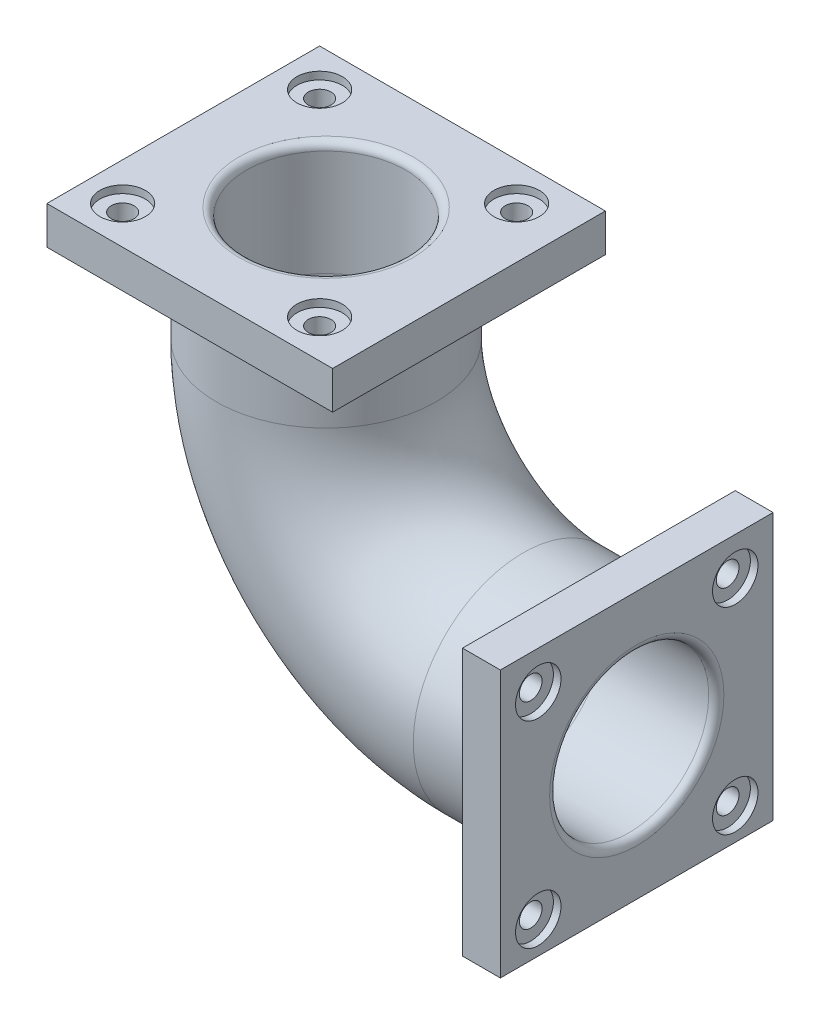
ISO-10303-21;
HEADER;
FILE_DESCRIPTION(('STEP AP214'),'2;1');
FILE_NAME('part.step','',(''),(''),'','','');
FILE_SCHEMA(('AUTOMOTIVE_DESIGN { 1 0 10303 214 1 1 1 1 }'));
ENDSEC;
DATA;
#1=APPLICATION_CONTEXT('core data for automotive mechanical design processes');
#2=APPLICATION_PROTOCOL_DEFINITION('international standard','automotive_design',2000,#1);
#3=PRODUCT_CONTEXT('',#1,'mechanical');
#4=PRODUCT('Part','Part','',(#3));
#5=PRODUCT_RELATED_PRODUCT_CATEGORY('part','',(#4));
#6=PRODUCT_DEFINITION_FORMATION('','',#4);
#7=PRODUCT_DEFINITION_CONTEXT('part definition',#1,'design');
#8=PRODUCT_DEFINITION('design','',#6,#7);
#9=PRODUCT_DEFINITION_SHAPE('','',#8);
#10=(LENGTH_UNIT() NAMED_UNIT(*) SI_UNIT(.MILLI.,.METRE.));
#11=(NAMED_UNIT(*) PLANE_ANGLE_UNIT() SI_UNIT($,.RADIAN.));
#12=(NAMED_UNIT(*) SI_UNIT($,.STERADIAN.) SOLID_ANGLE_UNIT());
#13=UNCERTAINTY_MEASURE_WITH_UNIT(LENGTH_MEASURE(1.E-05),#10,'distance_accuracy_value','');
#14=(GEOMETRIC_REPRESENTATION_CONTEXT(3) GLOBAL_UNCERTAINTY_ASSIGNED_CONTEXT((#13)) GLOBAL_UNIT_ASSIGNED_CONTEXT((#10,
#11,#12)) REPRESENTATION_CONTEXT('',''));
#15=CARTESIAN_POINT('',(0.,0.,0.));
#16=DIRECTION('',(0.,0.,1.));
#17=DIRECTION('',(1.,0.,0.));
#18=AXIS2_PLACEMENT_3D('',#15,#16,#17);
#19=CARTESIAN_POINT('',(-398.580538002043,100.,130.));
#20=DIRECTION('',(0.,1.,0.));
#21=DIRECTION('',(0.,0.,1.));
#22=AXIS2_PLACEMENT_3D('',#19,#20,#21);
#23=CYLINDRICAL_SURFACE('',#22,15.);
#24=CARTESIAN_POINT('',(-398.580538002043,100.,130.));
#25=DIRECTION('',(0.,1.,0.));
#26=DIRECTION('',(0.,0.,1.));
#27=AXIS2_PLACEMENT_3D('',#24,#25,#26);
#28=CIRCLE('',#27,15.);
#29=CARTESIAN_POINT('',(-398.580538002043,100.,145.));
#30=VERTEX_POINT('',#29);
#31=EDGE_CURVE('E392',#30,#30,#28,.T.);
#32=ORIENTED_EDGE('',*,*,#31,.F.);
#33=EDGE_LOOP('',(#32));
#34=FACE_BOUND('',#33,.T.);
#35=CARTESIAN_POINT('',(-398.580538002043,140.,130.));
#36=DIRECTION('',(0.,1.,0.));
#37=DIRECTION('',(0.,0.,1.));
#38=AXIS2_PLACEMENT_3D('',#35,#36,#37);
#39=CIRCLE('',#38,15.);
#40=CARTESIAN_POINT('',(-398.580538002043,140.,145.));
#41=VERTEX_POINT('',#40);
#42=EDGE_CURVE('E429',#41,#41,#39,.T.);
#43=ORIENTED_EDGE('',*,*,#42,.T.);
#44=EDGE_LOOP('',(#43));
#45=FACE_BOUND('',#44,.T.);
#46=ADVANCED_FACE('F33',(#34,#45),#23,.F.);
#47=CARTESIAN_POINT('',(-398.580538002044,100.,-130.));
#48=DIRECTION('',(0.,1.,0.));
#49=DIRECTION('',(0.,0.,1.));
#50=AXIS2_PLACEMENT_3D('',#47,#48,#49);
#51=CYLINDRICAL_SURFACE('',#50,15.);
#52=CARTESIAN_POINT('',(-398.580538002044,100.,-130.));
#53=DIRECTION('',(0.,1.,0.));
#54=DIRECTION('',(0.,0.,1.));
#55=AXIS2_PLACEMENT_3D('',#52,#53,#54);
#56=CIRCLE('',#55,15.);
#57=CARTESIAN_POINT('',(-398.580538002044,100.,-115.));
#58=VERTEX_POINT('',#57);
#59=EDGE_CURVE('E397',#58,#58,#56,.T.);
#60=ORIENTED_EDGE('',*,*,#59,.F.);
#61=EDGE_LOOP('',(#60));
#62=FACE_BOUND('',#61,.T.);
#63=CARTESIAN_POINT('',(-398.580538002044,140.,-130.));
#64=DIRECTION('',(0.,1.,0.));
#65=DIRECTION('',(0.,0.,1.));
#66=AXIS2_PLACEMENT_3D('',#63,#64,#65);
#67=CIRCLE('',#66,15.);
#68=CARTESIAN_POINT('',(-398.580538002044,140.,-115.));
#69=VERTEX_POINT('',#68);
#70=EDGE_CURVE('E438',#69,#69,#67,.T.);
#71=ORIENTED_EDGE('',*,*,#70,.T.);
#72=EDGE_LOOP('',(#71));
#73=FACE_BOUND('',#72,.T.);
#74=ADVANCED_FACE('F247',(#62,#73),#51,.F.);
#75=CARTESIAN_POINT('',(-138.580538002044,100.,-130.));
#76=DIRECTION('',(0.,1.,0.));
#77=DIRECTION('',(0.,0.,1.));
#78=AXIS2_PLACEMENT_3D('',#75,#76,#77);
#79=CYLINDRICAL_SURFACE('',#78,15.);
#80=CARTESIAN_POINT('',(-138.580538002044,100.,-130.));
#81=DIRECTION('',(0.,1.,0.));
#82=DIRECTION('',(0.,0.,1.));
#83=AXIS2_PLACEMENT_3D('',#80,#81,#82);
#84=CIRCLE('',#83,15.);
#85=CARTESIAN_POINT('',(-138.580538002044,100.,-115.));
#86=VERTEX_POINT('',#85);
#87=EDGE_CURVE('E411',#86,#86,#84,.T.);
#88=ORIENTED_EDGE('',*,*,#87,.F.);
#89=EDGE_LOOP('',(#88));
#90=FACE_BOUND('',#89,.T.);
#91=CARTESIAN_POINT('',(-138.580538002044,140.,-130.));
#92=DIRECTION('',(0.,1.,0.));
#93=DIRECTION('',(0.,0.,1.));
#94=AXIS2_PLACEMENT_3D('',#91,#92,#93);
#95=CIRCLE('',#94,15.);
#96=CARTESIAN_POINT('',(-138.580538002044,140.,-115.));
#97=VERTEX_POINT('',#96);
#98=EDGE_CURVE('E447',#97,#97,#95,.T.);
#99=ORIENTED_EDGE('',*,*,#98,.T.);
#100=EDGE_LOOP('',(#99));
#101=FACE_BOUND('',#100,.T.);
#102=ADVANCED_FACE('F254',(#90,#101),#79,.F.);
#103=CARTESIAN_POINT('',(-138.580538002043,100.,130.));
#104=DIRECTION('',(0.,1.,0.));
#105=DIRECTION('',(0.,0.,1.));
#106=AXIS2_PLACEMENT_3D('',#103,#104,#105);
#107=CYLINDRICAL_SURFACE('',#106,15.);
#108=CARTESIAN_POINT('',(-138.580538002043,100.,130.));
#109=DIRECTION('',(0.,1.,0.));
#110=DIRECTION('',(0.,0.,1.));
#111=AXIS2_PLACEMENT_3D('',#108,#109,#110);
#112=CIRCLE('',#111,15.);
#113=CARTESIAN_POINT('',(-138.580538002043,100.,145.));
#114=VERTEX_POINT('',#113);
#115=EDGE_CURVE('E408',#114,#114,#112,.T.);
#116=ORIENTED_EDGE('',*,*,#115,.F.);
#117=EDGE_LOOP('',(#116));
#118=FACE_BOUND('',#117,.T.);
#119=CARTESIAN_POINT('',(-138.580538002043,140.,130.));
#120=DIRECTION('',(0.,1.,0.));
#121=DIRECTION('',(0.,0.,1.));
#122=AXIS2_PLACEMENT_3D('',#119,#120,#121);
#123=CIRCLE('',#122,15.);
#124=CARTESIAN_POINT('',(-138.580538002043,140.,145.));
#125=VERTEX_POINT('',#124);
#126=EDGE_CURVE('E420',#125,#125,#123,.T.);
#127=ORIENTED_EDGE('',*,*,#126,.T.);
#128=EDGE_LOOP('',(#127));
#129=FACE_BOUND('',#128,.T.);
#130=ADVANCED_FACE('F265',(#118,#129),#107,.F.);
#131=CARTESIAN_POINT('',(100.,-133.957330411575,130.));
#132=DIRECTION('',(1.,0.,0.));
#133=DIRECTION('',(0.,0.,-1.));
#134=AXIS2_PLACEMENT_3D('',#131,#132,#133);
#135=CYLINDRICAL_SURFACE('',#134,15.);
#136=CARTESIAN_POINT('',(100.,-133.957330411575,130.));
#137=DIRECTION('',(1.,0.,0.));
#138=DIRECTION('',(0.,0.,-1.));
#139=AXIS2_PLACEMENT_3D('',#136,#137,#138);
#140=CIRCLE('',#139,15.);
#141=CARTESIAN_POINT('',(100.,-133.957330411575,115.));
#142=VERTEX_POINT('',#141);
#143=EDGE_CURVE('E182',#142,#142,#140,.T.);
#144=ORIENTED_EDGE('',*,*,#143,.F.);
#145=EDGE_LOOP('',(#144));
#146=FACE_BOUND('',#145,.T.);
#147=CARTESIAN_POINT('',(140.,-133.957330411575,130.));
#148=DIRECTION('',(1.,0.,0.));
#149=DIRECTION('',(0.,0.,-1.));
#150=AXIS2_PLACEMENT_3D('',#147,#148,#149);
#151=CIRCLE('',#150,15.);
#152=CARTESIAN_POINT('',(140.,-133.957330411575,115.));
#153=VERTEX_POINT('',#152);
#154=EDGE_CURVE('E167',#153,#153,#151,.T.);
#155=ORIENTED_EDGE('',*,*,#154,.T.);
#156=EDGE_LOOP('',(#155));
#157=FACE_BOUND('',#156,.T.);
#158=ADVANCED_FACE('F269',(#146,#157),#135,.F.);
#159=CARTESIAN_POINT('',(100.,-133.957330411575,-130.));
#160=DIRECTION('',(1.,0.,0.));
#161=DIRECTION('',(0.,0.,-1.));
#162=AXIS2_PLACEMENT_3D('',#159,#160,#161);
#163=CYLINDRICAL_SURFACE('',#162,15.);
#164=CARTESIAN_POINT('',(100.,-133.957330411575,-130.));
#165=DIRECTION('',(1.,0.,0.));
#166=DIRECTION('',(0.,0.,-1.));
#167=AXIS2_PLACEMENT_3D('',#164,#165,#166);
#168=CIRCLE('',#167,15.);
#169=CARTESIAN_POINT('',(100.,-133.957330411575,-145.));
#170=VERTEX_POINT('',#169);
#171=EDGE_CURVE('E179',#170,#170,#168,.T.);
#172=ORIENTED_EDGE('',*,*,#171,.F.);
#173=EDGE_LOOP('',(#172));
#174=FACE_BOUND('',#173,.T.);
#175=CARTESIAN_POINT('',(140.,-133.957330411575,-130.));
#176=DIRECTION('',(1.,0.,0.));
#177=DIRECTION('',(0.,0.,-1.));
#178=AXIS2_PLACEMENT_3D('',#175,#176,#177);
#179=CIRCLE('',#178,15.);
#180=CARTESIAN_POINT('',(140.,-133.957330411575,-145.));
#181=VERTEX_POINT('',#180);
#182=EDGE_CURVE('E151',#181,#181,#179,.T.);
#183=ORIENTED_EDGE('',*,*,#182,.T.);
#184=EDGE_LOOP('',(#183));
#185=FACE_BOUND('',#184,.T.);
#186=ADVANCED_FACE('F322',(#174,#185),#163,.F.);
#187=CARTESIAN_POINT('',(100.,-393.957330411575,-130.000000000003));
#188=DIRECTION('',(1.,0.,0.));
#189=DIRECTION('',(0.,0.,-1.));
#190=AXIS2_PLACEMENT_3D('',#187,#188,#189);
#191=CYLINDRICAL_SURFACE('',#190,15.);
#192=CARTESIAN_POINT('',(100.,-393.957330411575,-130.000000000003));
#193=DIRECTION('',(1.,0.,0.));
#194=DIRECTION('',(0.,0.,-1.));
#195=AXIS2_PLACEMENT_3D('',#192,#193,#194);
#196=CIRCLE('',#195,15.);
#197=CARTESIAN_POINT('',(100.,-393.957330411575,-145.000000000003));
#198=VERTEX_POINT('',#197);
#199=EDGE_CURVE('E183',#198,#198,#196,.T.);
#200=ORIENTED_EDGE('',*,*,#199,.F.);
#201=EDGE_LOOP('',(#200));
#202=FACE_BOUND('',#201,.T.);
#203=CARTESIAN_POINT('',(140.,-393.957330411575,-130.000000000003));
#204=DIRECTION('',(1.,0.,0.));
#205=DIRECTION('',(0.,0.,-1.));
#206=AXIS2_PLACEMENT_3D('',#203,#204,#205);
#207=CIRCLE('',#206,15.);
#208=CARTESIAN_POINT('',(140.,-393.957330411575,-145.000000000003));
#209=VERTEX_POINT('',#208);
#210=EDGE_CURVE('E143',#209,#209,#207,.T.);
#211=ORIENTED_EDGE('',*,*,#210,.T.);
#212=EDGE_LOOP('',(#211));
#213=FACE_BOUND('',#212,.T.);
#214=ADVANCED_FACE('F325',(#202,#213),#191,.F.);
#215=CARTESIAN_POINT('',(100.,-393.957330411575,129.999999999997));
#216=DIRECTION('',(1.,0.,0.));
#217=DIRECTION('',(0.,0.,-1.));
#218=AXIS2_PLACEMENT_3D('',#215,#216,#217);
#219=CYLINDRICAL_SURFACE('',#218,15.);
#220=CARTESIAN_POINT('',(100.,-393.957330411575,129.999999999997));
#221=DIRECTION('',(1.,0.,0.));
#222=DIRECTION('',(0.,0.,-1.));
#223=AXIS2_PLACEMENT_3D('',#220,#221,#222);
#224=CIRCLE('',#223,15.);
#225=CARTESIAN_POINT('',(100.,-393.957330411575,114.999999999997));
#226=VERTEX_POINT('',#225);
#227=EDGE_CURVE('E176',#226,#226,#224,.T.);
#228=ORIENTED_EDGE('',*,*,#227,.F.);
#229=EDGE_LOOP('',(#228));
#230=FACE_BOUND('',#229,.T.);
#231=CARTESIAN_POINT('',(140.,-393.957330411575,129.999999999997));
#232=DIRECTION('',(1.,0.,0.));
#233=DIRECTION('',(0.,0.,-1.));
#234=AXIS2_PLACEMENT_3D('',#231,#232,#233);
#235=CIRCLE('',#234,15.);
#236=CARTESIAN_POINT('',(140.,-393.957330411575,114.999999999997));
#237=VERTEX_POINT('',#236);
#238=EDGE_CURVE('E137',#237,#237,#235,.T.);
#239=ORIENTED_EDGE('',*,*,#238,.T.);
#240=EDGE_LOOP('',(#239));
#241=FACE_BOUND('',#240,.T.);
#242=ADVANCED_FACE('F329',(#230,#241),#219,.F.);
#243=CARTESIAN_POINT('',(-260.,100.,0.));
#244=DIRECTION('',(0.,-1.,0.));
#245=DIRECTION('',(0.,0.,-1.));
#246=AXIS2_PLACEMENT_3D('',#243,#244,#245);
#247=CYLINDRICAL_SURFACE('',#246,145.);
#248=CARTESIAN_POINT('',(-260.,0.,0.));
#249=DIRECTION('',(0.,-1.,0.));
#250=DIRECTION('',(0.,0.,-1.));
#251=AXIS2_PLACEMENT_3D('',#248,#249,#250);
#252=CIRCLE('',#251,145.);
#253=CARTESIAN_POINT('',(-405.,0.,0.));
#254=VERTEX_POINT('',#253);
#255=EDGE_CURVE('E216',#254,#254,#252,.T.);
#256=ORIENTED_EDGE('',*,*,#255,.F.);
#257=EDGE_LOOP('',(#256));
#258=FACE_BOUND('',#257,.T.);
#259=CARTESIAN_POINT('',(-260.,100.,0.));
#260=DIRECTION('',(0.,-1.,0.));
#261=DIRECTION('',(0.,0.,-1.));
#262=AXIS2_PLACEMENT_3D('',#259,#260,#261);
#263=CIRCLE('',#262,145.);
#264=CARTESIAN_POINT('',(-260.,100.,-145.));
#265=VERTEX_POINT('',#264);
#266=EDGE_CURVE('E134',#265,#265,#263,.T.);
#267=ORIENTED_EDGE('',*,*,#266,.T.);
#268=EDGE_LOOP('',(#267));
#269=FACE_BOUND('',#268,.T.);
#270=ADVANCED_FACE('F333',(#258,#269),#247,.T.);
#271=CARTESIAN_POINT('',(0.,0.,0.));
#272=DIRECTION('',(0.,0.,1.));
#273=DIRECTION('',(1.,0.,0.));
#274=AXIS2_PLACEMENT_3D('',#271,#272,#273);
#275=TOROIDAL_SURFACE('',#274,260.,145.);
#276=CARTESIAN_POINT('',(0.,-260.,0.));
#277=DIRECTION('',(1.,0.,0.));
#278=DIRECTION('',(0.,0.,-1.));
#279=AXIS2_PLACEMENT_3D('',#276,#277,#278);
#280=CIRCLE('',#279,145.);
#281=CARTESIAN_POINT('',(0.,-405.,0.));
#282=VERTEX_POINT('',#281);
#283=EDGE_CURVE('E220',#282,#282,#280,.T.);
#284=CARTESIAN_POINT('',(0.,0.,0.));
#285=DIRECTION('',(0.,0.,1.));
#286=DIRECTION('',(1.,0.,0.));
#287=AXIS2_PLACEMENT_3D('',#284,#285,#286);
#288=CIRCLE('',#287,405.);
#289=EDGE_CURVE('',#254,#282,#288,.T.);
#290=ORIENTED_EDGE('',*,*,#255,.T.);
#291=ORIENTED_EDGE('',*,*,#283,.F.);
#292=ORIENTED_EDGE('',*,*,#289,.T.);
#293=ORIENTED_EDGE('',*,*,#289,.F.);
#294=EDGE_LOOP('',(#290,#292,#291,#293));
#295=FACE_BOUND('',#294,.T.);
#296=ADVANCED_FACE('F371',(#295),#275,.T.);
#297=CARTESIAN_POINT('',(0.,-260.,0.));
#298=DIRECTION('',(1.,0.,0.));
#299=DIRECTION('',(0.,0.,-1.));
#300=AXIS2_PLACEMENT_3D('',#297,#298,#299);
#301=CYLINDRICAL_SURFACE('',#300,145.);
#302=CARTESIAN_POINT('',(100.,-260.,0.));
#303=DIRECTION('',(1.,0.,0.));
#304=DIRECTION('',(0.,0.,-1.));
#305=AXIS2_PLACEMENT_3D('',#302,#303,#304);
#306=CIRCLE('',#305,145.);
#307=CARTESIAN_POINT('',(100.,-260.,-145.));
#308=VERTEX_POINT('',#307);
#309=EDGE_CURVE('E223',#308,#308,#306,.T.);
#310=ORIENTED_EDGE('',*,*,#309,.F.);
#311=EDGE_LOOP('',(#310));
#312=FACE_BOUND('',#311,.T.);
#313=ORIENTED_EDGE('',*,*,#283,.T.);
#314=EDGE_LOOP('',(#313));
#315=FACE_BOUND('',#314,.T.);
#316=ADVANCED_FACE('F335',(#312,#315),#301,.T.);
#317=CARTESIAN_POINT('',(-260.,100.,0.));
#318=DIRECTION('',(0.,-1.,0.));
#319=DIRECTION('',(0.,0.,-1.));
#320=AXIS2_PLACEMENT_3D('',#317,#318,#319);
#321=CYLINDRICAL_SURFACE('',#320,105.);
#322=CARTESIAN_POINT('',(-260.,140.,0.));
#323=DIRECTION('',(0.,1.,0.));
#324=DIRECTION('',(0.,0.,1.));
#325=AXIS2_PLACEMENT_3D('',#322,#323,#324);
#326=CIRCLE('',#325,105.);
#327=CARTESIAN_POINT('',(-260.,140.,105.));
#328=VERTEX_POINT('',#327);
#329=EDGE_CURVE('E226',#328,#328,#326,.T.);
#330=ORIENTED_EDGE('',*,*,#329,.T.);
#331=EDGE_LOOP('',(#330));
#332=FACE_BOUND('',#331,.T.);
#333=CARTESIAN_POINT('',(-260.,0.,0.));
#334=DIRECTION('',(0.,1.,0.));
#335=DIRECTION('',(-1.,0.,0.));
#336=AXIS2_PLACEMENT_3D('',#333,#334,#335);
#337=CIRCLE('',#336,105.);
#338=CARTESIAN_POINT('',(-365.,0.,0.));
#339=VERTEX_POINT('',#338);
#340=EDGE_CURVE('E211',#339,#339,#337,.F.);
#341=ORIENTED_EDGE('',*,*,#340,.T.);
#342=EDGE_LOOP('',(#341));
#343=FACE_BOUND('',#342,.T.);
#344=ADVANCED_FACE('F348',(#332,#343),#321,.F.);
#345=CARTESIAN_POINT('',(0.,0.,0.));
#346=DIRECTION('',(0.,0.,1.));
#347=DIRECTION('',(1.,0.,0.));
#348=AXIS2_PLACEMENT_3D('',#345,#346,#347);
#349=TOROIDAL_SURFACE('',#348,260.,105.);
#350=CARTESIAN_POINT('',(0.,-260.,0.));
#351=DIRECTION('',(1.,0.,0.));
#352=DIRECTION('',(0.,0.,-1.));
#353=AXIS2_PLACEMENT_3D('',#350,#351,#352);
#354=CIRCLE('',#353,105.);
#355=CARTESIAN_POINT('',(0.,-365.,0.));
#356=VERTEX_POINT('',#355);
#357=EDGE_CURVE('E214',#356,#356,#354,.T.);
#358=CARTESIAN_POINT('',(0.,0.,0.));
#359=DIRECTION('',(0.,0.,1.));
#360=DIRECTION('',(1.,0.,0.));
#361=AXIS2_PLACEMENT_3D('',#358,#359,#360);
#362=CIRCLE('',#361,365.);
#363=EDGE_CURVE('',#339,#356,#362,.T.);
#364=ORIENTED_EDGE('',*,*,#340,.F.);
#365=ORIENTED_EDGE('',*,*,#357,.T.);
#366=ORIENTED_EDGE('',*,*,#363,.T.);
#367=ORIENTED_EDGE('',*,*,#363,.F.);
#368=EDGE_LOOP('',(#364,#366,#365,#367));
#369=FACE_BOUND('',#368,.T.);
#370=ADVANCED_FACE('F362',(#369),#349,.F.);
#371=CARTESIAN_POINT('',(0.,-260.,0.));
#372=DIRECTION('',(1.,0.,0.));
#373=DIRECTION('',(0.,0.,-1.));
#374=AXIS2_PLACEMENT_3D('',#371,#372,#373);
#375=CYLINDRICAL_SURFACE('',#374,105.);
#376=CARTESIAN_POINT('',(140.,-260.,0.));
#377=DIRECTION('',(-1.,0.,0.));
#378=DIRECTION('',(0.,0.,1.));
#379=AXIS2_PLACEMENT_3D('',#376,#377,#378);
#380=CIRCLE('',#379,105.);
#381=CARTESIAN_POINT('',(140.,-260.,105.));
#382=VERTEX_POINT('',#381);
#383=EDGE_CURVE('E42',#382,#382,#380,.F.);
#384=ORIENTED_EDGE('',*,*,#383,.T.);
#385=EDGE_LOOP('',(#384));
#386=FACE_BOUND('',#385,.T.);
#387=ORIENTED_EDGE('',*,*,#357,.F.);
#388=EDGE_LOOP('',(#387));
#389=FACE_BOUND('',#388,.T.);
#390=ADVANCED_FACE('F234',(#386,#389),#375,.F.);
#391=CARTESIAN_POINT('',(100.,0.,0.));
#392=DIRECTION('',(-1.,0.,0.));
#393=DIRECTION('',(0.,0.,1.));
#394=AXIS2_PLACEMENT_3D('',#391,#392,#393);
#395=PLANE('',#394);
#396=ORIENTED_EDGE('',*,*,#227,.T.);
#397=EDGE_LOOP('',(#396));
#398=FACE_BOUND('',#397,.T.);
#399=ORIENTED_EDGE('',*,*,#199,.T.);
#400=EDGE_LOOP('',(#399));
#401=FACE_BOUND('',#400,.T.);
#402=ORIENTED_EDGE('',*,*,#171,.T.);
#403=EDGE_LOOP('',(#402));
#404=FACE_BOUND('',#403,.T.);
#405=ORIENTED_EDGE('',*,*,#143,.T.);
#406=EDGE_LOOP('',(#405));
#407=FACE_BOUND('',#406,.T.);
#408=ORIENTED_EDGE('',*,*,#309,.T.);
#409=EDGE_LOOP('',(#408));
#410=FACE_BOUND('',#409,.T.);
#411=DIRECTION('',(0.,1.,0.));
#412=VECTOR('',#411,1.);
#413=CARTESIAN_POINT('',(100.,-436.042669588426,-180.));
#414=LINE('',#413,#412);
#415=CARTESIAN_POINT('',(100.,-436.042669588426,-180.));
#416=VERTEX_POINT('',#415);
#417=CARTESIAN_POINT('',(100.,-83.9573304115746,-180.));
#418=VERTEX_POINT('',#417);
#419=EDGE_CURVE('E190',#416,#418,#414,.T.);
#420=ORIENTED_EDGE('',*,*,#419,.F.);
#421=DIRECTION('',(0.,0.,-1.));
#422=VECTOR('',#421,1.);
#423=CARTESIAN_POINT('',(100.,-436.042669588426,180.));
#424=LINE('',#423,#422);
#425=CARTESIAN_POINT('',(100.,-436.042669588426,180.));
#426=VERTEX_POINT('',#425);
#427=EDGE_CURVE('E74',#426,#416,#424,.T.);
#428=ORIENTED_EDGE('',*,*,#427,.F.);
#429=DIRECTION('',(0.,-1.,0.));
#430=VECTOR('',#429,1.);
#431=CARTESIAN_POINT('',(100.,-436.042669588426,180.));
#432=LINE('',#431,#430);
#433=CARTESIAN_POINT('',(100.,-83.9573304115746,180.));
#434=VERTEX_POINT('',#433);
#435=EDGE_CURVE('E68',#434,#426,#432,.T.);
#436=ORIENTED_EDGE('',*,*,#435,.F.);
#437=DIRECTION('',(0.,0.,1.));
#438=VECTOR('',#437,1.);
#439=CARTESIAN_POINT('',(100.,-83.9573304115746,180.));
#440=LINE('',#439,#438);
#441=EDGE_CURVE('E200',#418,#434,#440,.T.);
#442=ORIENTED_EDGE('',*,*,#441,.F.);
#443=EDGE_LOOP('',(#420,#428,#436,#442));
#444=FACE_BOUND('',#443,.T.);
#445=ADVANCED_FACE('F343',(#398,#401,#404,#407,#410,#444),#395,.T.);
#446=CARTESIAN_POINT('',(150.,0.,0.));
#447=DIRECTION('',(-1.,0.,0.));
#448=DIRECTION('',(0.,0.,1.));
#449=AXIS2_PLACEMENT_3D('',#446,#447,#448);
#450=PLANE('',#449);
#451=CARTESIAN_POINT('',(150.,-260.,0.));
#452=DIRECTION('',(-1.,0.,0.));
#453=DIRECTION('',(0.,0.,1.));
#454=AXIS2_PLACEMENT_3D('',#451,#452,#453);
#455=CIRCLE('',#454,115.);
#456=CARTESIAN_POINT('',(150.,-260.,115.));
#457=VERTEX_POINT('',#456);
#458=EDGE_CURVE('E11',#457,#457,#455,.T.);
#459=ORIENTED_EDGE('',*,*,#458,.T.);
#460=EDGE_LOOP('',(#459));
#461=FACE_BOUND('',#460,.T.);
#462=CARTESIAN_POINT('',(150.,-133.957330411575,-130.));
#463=DIRECTION('',(1.,0.,0.));
#464=DIRECTION('',(0.,0.,-1.));
#465=AXIS2_PLACEMENT_3D('',#462,#463,#464);
#466=CIRCLE('',#465,30.);
#467=CARTESIAN_POINT('',(150.,-133.957330411575,-160.));
#468=VERTEX_POINT('',#467);
#469=EDGE_CURVE('E163',#468,#468,#466,.T.);
#470=ORIENTED_EDGE('',*,*,#469,.F.);
#471=EDGE_LOOP('',(#470));
#472=FACE_BOUND('',#471,.T.);
#473=CARTESIAN_POINT('',(150.,-393.957330411575,-130.000000000003));
#474=DIRECTION('',(1.,0.,0.));
#475=DIRECTION('',(0.,0.,-1.));
#476=AXIS2_PLACEMENT_3D('',#473,#474,#475);
#477=CIRCLE('',#476,30.);
#478=CARTESIAN_POINT('',(150.,-393.957330411575,-160.000000000003));
#479=VERTEX_POINT('',#478);
#480=EDGE_CURVE('E146',#479,#479,#477,.T.);
#481=ORIENTED_EDGE('',*,*,#480,.F.);
#482=EDGE_LOOP('',(#481));
#483=FACE_BOUND('',#482,.T.);
#484=CARTESIAN_POINT('',(150.,-393.957330411575,129.999999999997));
#485=DIRECTION('',(1.,0.,0.));
#486=DIRECTION('',(0.,0.,-1.));
#487=AXIS2_PLACEMENT_3D('',#484,#485,#486);
#488=CIRCLE('',#487,30.);
#489=CARTESIAN_POINT('',(150.,-393.957330411575,99.9999999999972));
#490=VERTEX_POINT('',#489);
#491=EDGE_CURVE('E156',#490,#490,#488,.T.);
#492=ORIENTED_EDGE('',*,*,#491,.F.);
#493=EDGE_LOOP('',(#492));
#494=FACE_BOUND('',#493,.T.);
#495=CARTESIAN_POINT('',(150.,-133.957330411575,130.));
#496=DIRECTION('',(1.,0.,0.));
#497=DIRECTION('',(0.,0.,-1.));
#498=AXIS2_PLACEMENT_3D('',#495,#496,#497);
#499=CIRCLE('',#498,30.);
#500=CARTESIAN_POINT('',(150.,-133.957330411575,99.9999999999999));
#501=VERTEX_POINT('',#500);
#502=EDGE_CURVE('E172',#501,#501,#499,.T.);
#503=ORIENTED_EDGE('',*,*,#502,.F.);
#504=EDGE_LOOP('',(#503));
#505=FACE_BOUND('',#504,.T.);
#506=DIRECTION('',(0.,1.,0.));
#507=VECTOR('',#506,1.);
#508=CARTESIAN_POINT('',(150.,-436.042669588426,-180.));
#509=LINE('',#508,#507);
#510=CARTESIAN_POINT('',(150.,-436.042669588426,-180.));
#511=VERTEX_POINT('',#510);
#512=CARTESIAN_POINT('',(150.,-83.9573304115746,-180.));
#513=VERTEX_POINT('',#512);
#514=EDGE_CURVE('E191',#511,#513,#509,.T.);
#515=ORIENTED_EDGE('',*,*,#514,.T.);
#516=DIRECTION('',(0.,0.,1.));
#517=VECTOR('',#516,1.);
#518=CARTESIAN_POINT('',(150.,-83.9573304115746,180.));
#519=LINE('',#518,#517);
#520=CARTESIAN_POINT('',(150.,-83.9573304115746,180.));
#521=VERTEX_POINT('',#520);
#522=EDGE_CURVE('E82',#513,#521,#519,.T.);
#523=ORIENTED_EDGE('',*,*,#522,.T.);
#524=DIRECTION('',(0.,-1.,0.));
#525=VECTOR('',#524,1.);
#526=CARTESIAN_POINT('',(150.,-436.042669588426,180.));
#527=LINE('',#526,#525);
#528=CARTESIAN_POINT('',(150.,-436.042669588426,180.));
#529=VERTEX_POINT('',#528);
#530=EDGE_CURVE('E194',#521,#529,#527,.T.);
#531=ORIENTED_EDGE('',*,*,#530,.T.);
#532=DIRECTION('',(0.,0.,-1.));
#533=VECTOR('',#532,1.);
#534=CARTESIAN_POINT('',(150.,-436.042669588426,180.));
#535=LINE('',#534,#533);
#536=EDGE_CURVE('E50',#529,#511,#535,.T.);
#537=ORIENTED_EDGE('',*,*,#536,.T.);
#538=EDGE_LOOP('',(#515,#523,#531,#537));
#539=FACE_BOUND('',#538,.T.);
#540=ADVANCED_FACE('F339',(#461,#472,#483,#494,#505,#539),#450,.F.);
#541=CARTESIAN_POINT('',(150.,-436.042669588426,180.));
#542=DIRECTION('',(0.,1.,0.));
#543=DIRECTION('',(0.,0.,1.));
#544=AXIS2_PLACEMENT_3D('',#541,#542,#543);
#545=PLANE('',#544);
#546=ORIENTED_EDGE('',*,*,#427,.T.);
#547=DIRECTION('',(-1.,0.,0.));
#548=VECTOR('',#547,1.);
#549=CARTESIAN_POINT('',(150.,-436.042669588426,-180.));
#550=LINE('',#549,#548);
#551=EDGE_CURVE('E197',#511,#416,#550,.T.);
#552=ORIENTED_EDGE('',*,*,#551,.F.);
#553=ORIENTED_EDGE('',*,*,#536,.F.);
#554=DIRECTION('',(-1.,0.,0.));
#555=VECTOR('',#554,1.);
#556=CARTESIAN_POINT('',(150.,-436.042669588426,180.));
#557=LINE('',#556,#555);
#558=EDGE_CURVE('E205',#529,#426,#557,.T.);
#559=ORIENTED_EDGE('',*,*,#558,.T.);
#560=EDGE_LOOP('',(#546,#552,#553,#559));
#561=FACE_BOUND('',#560,.T.);
#562=ADVANCED_FACE('F342',(#561),#545,.F.);
#563=CARTESIAN_POINT('',(150.,-436.042669588426,180.));
#564=DIRECTION('',(0.,0.,-1.));
#565=DIRECTION('',(-1.,0.,0.));
#566=AXIS2_PLACEMENT_3D('',#563,#564,#565);
#567=PLANE('',#566);
#568=ORIENTED_EDGE('',*,*,#435,.T.);
#569=ORIENTED_EDGE('',*,*,#558,.F.);
#570=ORIENTED_EDGE('',*,*,#530,.F.);
#571=DIRECTION('',(-1.,0.,0.));
#572=VECTOR('',#571,1.);
#573=CARTESIAN_POINT('',(150.,-83.9573304115746,180.));
#574=LINE('',#573,#572);
#575=EDGE_CURVE('E207',#521,#434,#574,.T.);
#576=ORIENTED_EDGE('',*,*,#575,.T.);
#577=EDGE_LOOP('',(#568,#569,#570,#576));
#578=FACE_BOUND('',#577,.T.);
#579=ADVANCED_FACE('F351',(#578),#567,.F.);
#580=CARTESIAN_POINT('',(150.,-83.9573304115746,180.));
#581=DIRECTION('',(0.,-1.,0.));
#582=DIRECTION('',(0.,0.,-1.));
#583=AXIS2_PLACEMENT_3D('',#580,#581,#582);
#584=PLANE('',#583);
#585=ORIENTED_EDGE('',*,*,#441,.T.);
#586=ORIENTED_EDGE('',*,*,#575,.F.);
#587=ORIENTED_EDGE('',*,*,#522,.F.);
#588=DIRECTION('',(-1.,0.,0.));
#589=VECTOR('',#588,1.);
#590=CARTESIAN_POINT('',(150.,-83.9573304115746,-180.));
#591=LINE('',#590,#589);
#592=EDGE_CURVE('E209',#513,#418,#591,.T.);
#593=ORIENTED_EDGE('',*,*,#592,.T.);
#594=EDGE_LOOP('',(#585,#586,#587,#593));
#595=FACE_BOUND('',#594,.T.);
#596=ADVANCED_FACE('F354',(#595),#584,.F.);
#597=CARTESIAN_POINT('',(150.,-436.042669588426,-180.));
#598=DIRECTION('',(0.,0.,1.));
#599=DIRECTION('',(1.,0.,0.));
#600=AXIS2_PLACEMENT_3D('',#597,#598,#599);
#601=PLANE('',#600);
#602=ORIENTED_EDGE('',*,*,#419,.T.);
#603=ORIENTED_EDGE('',*,*,#592,.F.);
#604=ORIENTED_EDGE('',*,*,#514,.F.);
#605=ORIENTED_EDGE('',*,*,#551,.T.);
#606=EDGE_LOOP('',(#602,#603,#604,#605));
#607=FACE_BOUND('',#606,.T.);
#608=ADVANCED_FACE('F307',(#607),#601,.F.);
#609=CARTESIAN_POINT('',(140.,-393.957330411575,129.999999999997));
#610=DIRECTION('',(1.,0.,0.));
#611=DIRECTION('',(0.,0.,-1.));
#612=AXIS2_PLACEMENT_3D('',#609,#610,#611);
#613=CYLINDRICAL_SURFACE('',#612,30.);
#614=CARTESIAN_POINT('',(140.,-393.957330411575,129.999999999997));
#615=DIRECTION('',(1.,0.,0.));
#616=DIRECTION('',(0.,0.,-1.));
#617=AXIS2_PLACEMENT_3D('',#614,#615,#616);
#618=CIRCLE('',#617,30.);
#619=CARTESIAN_POINT('',(140.,-393.957330411575,99.9999999999972));
#620=VERTEX_POINT('',#619);
#621=EDGE_CURVE('E147',#620,#620,#618,.T.);
#622=ORIENTED_EDGE('',*,*,#621,.F.);
#623=EDGE_LOOP('',(#622));
#624=FACE_BOUND('',#623,.T.);
#625=ORIENTED_EDGE('',*,*,#491,.T.);
#626=EDGE_LOOP('',(#625));
#627=FACE_BOUND('',#626,.T.);
#628=ADVANCED_FACE('F303',(#624,#627),#613,.F.);
#629=CARTESIAN_POINT('',(140.,-393.957330411575,129.999999999997));
#630=DIRECTION('',(1.,0.,0.));
#631=DIRECTION('',(0.,0.,-1.));
#632=AXIS2_PLACEMENT_3D('',#629,#630,#631);
#633=PLANE('',#632);
#634=ORIENTED_EDGE('',*,*,#238,.F.);
#635=EDGE_LOOP('',(#634));
#636=FACE_BOUND('',#635,.T.);
#637=ORIENTED_EDGE('',*,*,#621,.T.);
#638=EDGE_LOOP('',(#637));
#639=FACE_BOUND('',#638,.T.);
#640=ADVANCED_FACE('F299',(#636,#639),#633,.T.);
#641=CARTESIAN_POINT('',(140.,-393.957330411575,-130.000000000003));
#642=DIRECTION('',(1.,0.,0.));
#643=DIRECTION('',(0.,0.,-1.));
#644=AXIS2_PLACEMENT_3D('',#641,#642,#643);
#645=CYLINDRICAL_SURFACE('',#644,30.);
#646=CARTESIAN_POINT('',(140.,-393.957330411575,-130.000000000003));
#647=DIRECTION('',(1.,0.,0.));
#648=DIRECTION('',(0.,0.,-1.));
#649=AXIS2_PLACEMENT_3D('',#646,#647,#648);
#650=CIRCLE('',#649,30.);
#651=CARTESIAN_POINT('',(140.,-393.957330411575,-160.000000000003));
#652=VERTEX_POINT('',#651);
#653=EDGE_CURVE('E148',#652,#652,#650,.T.);
#654=ORIENTED_EDGE('',*,*,#653,.F.);
#655=EDGE_LOOP('',(#654));
#656=FACE_BOUND('',#655,.T.);
#657=ORIENTED_EDGE('',*,*,#480,.T.);
#658=EDGE_LOOP('',(#657));
#659=FACE_BOUND('',#658,.T.);
#660=ADVANCED_FACE('F295',(#656,#659),#645,.F.);
#661=CARTESIAN_POINT('',(140.,-393.957330411575,-130.000000000003));
#662=DIRECTION('',(1.,0.,0.));
#663=DIRECTION('',(0.,0.,-1.));
#664=AXIS2_PLACEMENT_3D('',#661,#662,#663);
#665=PLANE('',#664);
#666=ORIENTED_EDGE('',*,*,#210,.F.);
#667=EDGE_LOOP('',(#666));
#668=FACE_BOUND('',#667,.T.);
#669=ORIENTED_EDGE('',*,*,#653,.T.);
#670=EDGE_LOOP('',(#669));
#671=FACE_BOUND('',#670,.T.);
#672=ADVANCED_FACE('F291',(#668,#671),#665,.T.);
#673=CARTESIAN_POINT('',(140.,-133.957330411575,-130.));
#674=DIRECTION('',(1.,0.,0.));
#675=DIRECTION('',(0.,0.,-1.));
#676=AXIS2_PLACEMENT_3D('',#673,#674,#675);
#677=CYLINDRICAL_SURFACE('',#676,30.);
#678=CARTESIAN_POINT('',(140.,-133.957330411575,-130.));
#679=DIRECTION('',(1.,0.,0.));
#680=DIRECTION('',(0.,0.,-1.));
#681=AXIS2_PLACEMENT_3D('',#678,#679,#680);
#682=CIRCLE('',#681,30.);
#683=CARTESIAN_POINT('',(140.,-133.957330411575,-160.));
#684=VERTEX_POINT('',#683);
#685=EDGE_CURVE('E164',#684,#684,#682,.T.);
#686=ORIENTED_EDGE('',*,*,#685,.F.);
#687=EDGE_LOOP('',(#686));
#688=FACE_BOUND('',#687,.T.);
#689=ORIENTED_EDGE('',*,*,#469,.T.);
#690=EDGE_LOOP('',(#689));
#691=FACE_BOUND('',#690,.T.);
#692=ADVANCED_FACE('F294',(#688,#691),#677,.F.);
#693=CARTESIAN_POINT('',(140.,-133.957330411575,-130.));
#694=DIRECTION('',(1.,0.,0.));
#695=DIRECTION('',(0.,0.,-1.));
#696=AXIS2_PLACEMENT_3D('',#693,#694,#695);
#697=PLANE('',#696);
#698=ORIENTED_EDGE('',*,*,#182,.F.);
#699=EDGE_LOOP('',(#698));
#700=FACE_BOUND('',#699,.T.);
#701=ORIENTED_EDGE('',*,*,#685,.T.);
#702=EDGE_LOOP('',(#701));
#703=FACE_BOUND('',#702,.T.);
#704=ADVANCED_FACE('F309',(#700,#703),#697,.T.);
#705=CARTESIAN_POINT('',(140.,-133.957330411575,130.));
#706=DIRECTION('',(1.,0.,0.));
#707=DIRECTION('',(0.,0.,-1.));
#708=AXIS2_PLACEMENT_3D('',#705,#706,#707);
#709=CYLINDRICAL_SURFACE('',#708,30.);
#710=CARTESIAN_POINT('',(140.,-133.957330411575,130.));
#711=DIRECTION('',(1.,0.,0.));
#712=DIRECTION('',(0.,0.,-1.));
#713=AXIS2_PLACEMENT_3D('',#710,#711,#712);
#714=CIRCLE('',#713,30.);
#715=CARTESIAN_POINT('',(140.,-133.957330411575,99.9999999999999));
#716=VERTEX_POINT('',#715);
#717=EDGE_CURVE('E173',#716,#716,#714,.T.);
#718=ORIENTED_EDGE('',*,*,#717,.F.);
#719=EDGE_LOOP('',(#718));
#720=FACE_BOUND('',#719,.T.);
#721=ORIENTED_EDGE('',*,*,#502,.T.);
#722=EDGE_LOOP('',(#721));
#723=FACE_BOUND('',#722,.T.);
#724=ADVANCED_FACE('F312',(#720,#723),#709,.F.);
#725=CARTESIAN_POINT('',(140.,-133.957330411575,130.));
#726=DIRECTION('',(1.,0.,0.));
#727=DIRECTION('',(0.,0.,-1.));
#728=AXIS2_PLACEMENT_3D('',#725,#726,#727);
#729=PLANE('',#728);
#730=ORIENTED_EDGE('',*,*,#154,.F.);
#731=EDGE_LOOP('',(#730));
#732=FACE_BOUND('',#731,.T.);
#733=ORIENTED_EDGE('',*,*,#717,.T.);
#734=EDGE_LOOP('',(#733));
#735=FACE_BOUND('',#734,.T.);
#736=ADVANCED_FACE('F278',(#732,#735),#729,.T.);
#737=CARTESIAN_POINT('',(0.,100.,0.));
#738=DIRECTION('',(0.,1.,0.));
#739=DIRECTION('',(0.,0.,1.));
#740=AXIS2_PLACEMENT_3D('',#737,#738,#739);
#741=PLANE('',#740);
#742=ORIENTED_EDGE('',*,*,#115,.T.);
#743=EDGE_LOOP('',(#742));
#744=FACE_BOUND('',#743,.T.);
#745=ORIENTED_EDGE('',*,*,#87,.T.);
#746=EDGE_LOOP('',(#745));
#747=FACE_BOUND('',#746,.T.);
#748=ORIENTED_EDGE('',*,*,#59,.T.);
#749=EDGE_LOOP('',(#748));
#750=FACE_BOUND('',#749,.T.);
#751=ORIENTED_EDGE('',*,*,#31,.T.);
#752=EDGE_LOOP('',(#751));
#753=FACE_BOUND('',#752,.T.);
#754=ORIENTED_EDGE('',*,*,#266,.F.);
#755=EDGE_LOOP('',(#754));
#756=FACE_BOUND('',#755,.T.);
#757=DIRECTION('',(0.,0.,1.));
#758=VECTOR('',#757,1.);
#759=CARTESIAN_POINT('',(-448.580538002043,100.,180.));
#760=LINE('',#759,#758);
#761=CARTESIAN_POINT('',(-448.580538002043,100.,-180.));
#762=VERTEX_POINT('',#761);
#763=CARTESIAN_POINT('',(-448.580538002043,100.,180.));
#764=VERTEX_POINT('',#763);
#765=EDGE_CURVE('E133',#762,#764,#760,.T.);
#766=ORIENTED_EDGE('',*,*,#765,.F.);
#767=DIRECTION('',(-1.,0.,0.));
#768=VECTOR('',#767,1.);
#769=CARTESIAN_POINT('',(-71.4194619979567,100.,-180.));
#770=LINE('',#769,#768);
#771=CARTESIAN_POINT('',(-71.4194619979567,100.,-180.));
#772=VERTEX_POINT('',#771);
#773=EDGE_CURVE('E129',#772,#762,#770,.T.);
#774=ORIENTED_EDGE('',*,*,#773,.F.);
#775=DIRECTION('',(0.,0.,-1.));
#776=VECTOR('',#775,1.);
#777=CARTESIAN_POINT('',(-71.4194619979567,100.,180.));
#778=LINE('',#777,#776);
#779=CARTESIAN_POINT('',(-71.4194619979567,100.,180.));
#780=VERTEX_POINT('',#779);
#781=EDGE_CURVE('E394',#780,#772,#778,.T.);
#782=ORIENTED_EDGE('',*,*,#781,.F.);
#783=DIRECTION('',(1.,0.,0.));
#784=VECTOR('',#783,1.);
#785=CARTESIAN_POINT('',(-71.4194619979567,100.,180.));
#786=LINE('',#785,#784);
#787=EDGE_CURVE('E391',#764,#780,#786,.T.);
#788=ORIENTED_EDGE('',*,*,#787,.F.);
#789=EDGE_LOOP('',(#766,#774,#782,#788));
#790=FACE_BOUND('',#789,.T.);
#791=ADVANCED_FACE('F274',(#744,#747,#750,#753,#756,#790),#741,.F.);
#792=CARTESIAN_POINT('',(0.,150.,0.));
#793=DIRECTION('',(0.,1.,0.));
#794=DIRECTION('',(0.,0.,1.));
#795=AXIS2_PLACEMENT_3D('',#792,#793,#794);
#796=PLANE('',#795);
#797=CARTESIAN_POINT('',(-260.,150.,0.));
#798=DIRECTION('',(0.,1.,0.));
#799=DIRECTION('',(0.,0.,1.));
#800=AXIS2_PLACEMENT_3D('',#797,#798,#799);
#801=CIRCLE('',#800,115.);
#802=CARTESIAN_POINT('',(-260.,150.,115.));
#803=VERTEX_POINT('',#802);
#804=EDGE_CURVE('E229',#803,#803,#801,.F.);
#805=ORIENTED_EDGE('',*,*,#804,.T.);
#806=EDGE_LOOP('',(#805));
#807=FACE_BOUND('',#806,.T.);
#808=CARTESIAN_POINT('',(-398.580538002043,150.,130.));
#809=DIRECTION('',(0.,1.,0.));
#810=DIRECTION('',(0.,0.,1.));
#811=AXIS2_PLACEMENT_3D('',#808,#809,#810);
#812=CIRCLE('',#811,30.);
#813=CARTESIAN_POINT('',(-398.580538002043,150.,160.));
#814=VERTEX_POINT('',#813);
#815=EDGE_CURVE('E426',#814,#814,#812,.T.);
#816=ORIENTED_EDGE('',*,*,#815,.F.);
#817=EDGE_LOOP('',(#816));
#818=FACE_BOUND('',#817,.T.);
#819=CARTESIAN_POINT('',(-398.580538002044,150.,-130.));
#820=DIRECTION('',(0.,1.,0.));
#821=DIRECTION('',(0.,0.,1.));
#822=AXIS2_PLACEMENT_3D('',#819,#820,#821);
#823=CIRCLE('',#822,30.);
#824=CARTESIAN_POINT('',(-398.580538002044,150.,-100.));
#825=VERTEX_POINT('',#824);
#826=EDGE_CURVE('E433',#825,#825,#823,.T.);
#827=ORIENTED_EDGE('',*,*,#826,.F.);
#828=EDGE_LOOP('',(#827));
#829=FACE_BOUND('',#828,.T.);
#830=CARTESIAN_POINT('',(-138.580538002044,150.,-130.));
#831=DIRECTION('',(0.,1.,0.));
#832=DIRECTION('',(0.,0.,1.));
#833=AXIS2_PLACEMENT_3D('',#830,#831,#832);
#834=CIRCLE('',#833,30.);
#835=CARTESIAN_POINT('',(-138.580538002044,150.,-100.));
#836=VERTEX_POINT('',#835);
#837=EDGE_CURVE('E442',#836,#836,#834,.T.);
#838=ORIENTED_EDGE('',*,*,#837,.F.);
#839=EDGE_LOOP('',(#838));
#840=FACE_BOUND('',#839,.T.);
#841=CARTESIAN_POINT('',(-138.580538002043,150.,130.));
#842=DIRECTION('',(0.,1.,0.));
#843=DIRECTION('',(0.,0.,1.));
#844=AXIS2_PLACEMENT_3D('',#841,#842,#843);
#845=CIRCLE('',#844,30.);
#846=CARTESIAN_POINT('',(-138.580538002043,150.,160.));
#847=VERTEX_POINT('',#846);
#848=EDGE_CURVE('E417',#847,#847,#845,.T.);
#849=ORIENTED_EDGE('',*,*,#848,.F.);
#850=EDGE_LOOP('',(#849));
#851=FACE_BOUND('',#850,.T.);
#852=DIRECTION('',(0.,0.,1.));
#853=VECTOR('',#852,1.);
#854=CARTESIAN_POINT('',(-448.580538002043,150.,180.));
#855=LINE('',#854,#853);
#856=CARTESIAN_POINT('',(-448.580538002043,150.,-180.));
#857=VERTEX_POINT('',#856);
#858=CARTESIAN_POINT('',(-448.580538002043,150.,180.));
#859=VERTEX_POINT('',#858);
#860=EDGE_CURVE('E120',#857,#859,#855,.T.);
#861=ORIENTED_EDGE('',*,*,#860,.T.);
#862=DIRECTION('',(1.,0.,0.));
#863=VECTOR('',#862,1.);
#864=CARTESIAN_POINT('',(-71.4194619979567,150.,180.));
#865=LINE('',#864,#863);
#866=CARTESIAN_POINT('',(-71.4194619979567,150.,180.));
#867=VERTEX_POINT('',#866);
#868=EDGE_CURVE('E109',#859,#867,#865,.T.);
#869=ORIENTED_EDGE('',*,*,#868,.T.);
#870=DIRECTION('',(0.,0.,-1.));
#871=VECTOR('',#870,1.);
#872=CARTESIAN_POINT('',(-71.4194619979567,150.,180.));
#873=LINE('',#872,#871);
#874=CARTESIAN_POINT('',(-71.4194619979567,150.,-180.));
#875=VERTEX_POINT('',#874);
#876=EDGE_CURVE('E119',#867,#875,#873,.T.);
#877=ORIENTED_EDGE('',*,*,#876,.T.);
#878=DIRECTION('',(-1.,0.,0.));
#879=VECTOR('',#878,1.);
#880=CARTESIAN_POINT('',(-71.4194619979567,150.,-180.));
#881=LINE('',#880,#879);
#882=EDGE_CURVE('E125',#875,#857,#881,.T.);
#883=ORIENTED_EDGE('',*,*,#882,.T.);
#884=EDGE_LOOP('',(#861,#869,#877,#883));
#885=FACE_BOUND('',#884,.T.);
#886=ADVANCED_FACE('F123',(#807,#818,#829,#840,#851,#885),#796,.T.);
#887=CARTESIAN_POINT('',(-71.4194619979567,150.,-180.));
#888=DIRECTION('',(0.,0.,1.));
#889=DIRECTION('',(1.,0.,0.));
#890=AXIS2_PLACEMENT_3D('',#887,#888,#889);
#891=PLANE('',#890);
#892=ORIENTED_EDGE('',*,*,#773,.T.);
#893=DIRECTION('',(0.,-1.,0.));
#894=VECTOR('',#893,1.);
#895=CARTESIAN_POINT('',(-448.580538002043,150.,-180.));
#896=LINE('',#895,#894);
#897=EDGE_CURVE('E404',#857,#762,#896,.T.);
#898=ORIENTED_EDGE('',*,*,#897,.F.);
#899=ORIENTED_EDGE('',*,*,#882,.F.);
#900=DIRECTION('',(0.,-1.,0.));
#901=VECTOR('',#900,1.);
#902=CARTESIAN_POINT('',(-71.4194619979567,150.,-180.));
#903=LINE('',#902,#901);
#904=EDGE_CURVE('E139',#875,#772,#903,.T.);
#905=ORIENTED_EDGE('',*,*,#904,.T.);
#906=EDGE_LOOP('',(#892,#898,#899,#905));
#907=FACE_BOUND('',#906,.T.);
#908=ADVANCED_FACE('F273',(#907),#891,.F.);
#909=CARTESIAN_POINT('',(-71.4194619979567,150.,180.));
#910=DIRECTION('',(-1.,0.,0.));
#911=DIRECTION('',(0.,0.,1.));
#912=AXIS2_PLACEMENT_3D('',#909,#910,#911);
#913=PLANE('',#912);
#914=ORIENTED_EDGE('',*,*,#781,.T.);
#915=ORIENTED_EDGE('',*,*,#904,.F.);
#916=ORIENTED_EDGE('',*,*,#876,.F.);
#917=DIRECTION('',(0.,-1.,0.));
#918=VECTOR('',#917,1.);
#919=CARTESIAN_POINT('',(-71.4194619979567,150.,180.));
#920=LINE('',#919,#918);
#921=EDGE_CURVE('E116',#867,#780,#920,.T.);
#922=ORIENTED_EDGE('',*,*,#921,.T.);
#923=EDGE_LOOP('',(#914,#915,#916,#922));
#924=FACE_BOUND('',#923,.T.);
#925=ADVANCED_FACE('F282',(#924),#913,.F.);
#926=CARTESIAN_POINT('',(-71.4194619979567,150.,180.));
#927=DIRECTION('',(0.,0.,-1.));
#928=DIRECTION('',(-1.,0.,0.));
#929=AXIS2_PLACEMENT_3D('',#926,#927,#928);
#930=PLANE('',#929);
#931=ORIENTED_EDGE('',*,*,#787,.T.);
#932=ORIENTED_EDGE('',*,*,#921,.F.);
#933=ORIENTED_EDGE('',*,*,#868,.F.);
#934=DIRECTION('',(0.,-1.,0.));
#935=VECTOR('',#934,1.);
#936=CARTESIAN_POINT('',(-448.580538002043,150.,180.));
#937=LINE('',#936,#935);
#938=EDGE_CURVE('E113',#859,#764,#937,.T.);
#939=ORIENTED_EDGE('',*,*,#938,.T.);
#940=EDGE_LOOP('',(#931,#932,#933,#939));
#941=FACE_BOUND('',#940,.T.);
#942=ADVANCED_FACE('F111',(#941),#930,.F.);
#943=CARTESIAN_POINT('',(-448.580538002043,150.,180.));
#944=DIRECTION('',(1.,0.,0.));
#945=DIRECTION('',(0.,0.,-1.));
#946=AXIS2_PLACEMENT_3D('',#943,#944,#945);
#947=PLANE('',#946);
#948=ORIENTED_EDGE('',*,*,#765,.T.);
#949=ORIENTED_EDGE('',*,*,#938,.F.);
#950=ORIENTED_EDGE('',*,*,#860,.F.);
#951=ORIENTED_EDGE('',*,*,#897,.T.);
#952=EDGE_LOOP('',(#948,#949,#950,#951));
#953=FACE_BOUND('',#952,.T.);
#954=ADVANCED_FACE('F131',(#953),#947,.F.);
#955=CARTESIAN_POINT('',(-138.580538002043,140.,130.));
#956=DIRECTION('',(0.,1.,0.));
#957=DIRECTION('',(0.,0.,1.));
#958=AXIS2_PLACEMENT_3D('',#955,#956,#957);
#959=CYLINDRICAL_SURFACE('',#958,30.);
#960=CARTESIAN_POINT('',(-138.580538002043,140.,130.));
#961=DIRECTION('',(0.,1.,0.));
#962=DIRECTION('',(0.,0.,1.));
#963=AXIS2_PLACEMENT_3D('',#960,#961,#962);
#964=CIRCLE('',#963,30.);
#965=CARTESIAN_POINT('',(-138.580538002043,140.,160.));
#966=VERTEX_POINT('',#965);
#967=EDGE_CURVE('E412',#966,#966,#964,.T.);
#968=ORIENTED_EDGE('',*,*,#967,.F.);
#969=EDGE_LOOP('',(#968));
#970=FACE_BOUND('',#969,.T.);
#971=ORIENTED_EDGE('',*,*,#848,.T.);
#972=EDGE_LOOP('',(#971));
#973=FACE_BOUND('',#972,.T.);
#974=ADVANCED_FACE('F260',(#970,#973),#959,.F.);
#975=CARTESIAN_POINT('',(0.,140.,0.));
#976=DIRECTION('',(0.,1.,0.));
#977=DIRECTION('',(0.,0.,1.));
#978=AXIS2_PLACEMENT_3D('',#975,#976,#977);
#979=PLANE('',#978);
#980=ORIENTED_EDGE('',*,*,#126,.F.);
#981=EDGE_LOOP('',(#980));
#982=FACE_BOUND('',#981,.T.);
#983=ORIENTED_EDGE('',*,*,#967,.T.);
#984=EDGE_LOOP('',(#983));
#985=FACE_BOUND('',#984,.T.);
#986=ADVANCED_FACE('F464',(#982,#985),#979,.T.);
#987=CARTESIAN_POINT('',(-138.580538002044,140.,-130.));
#988=DIRECTION('',(0.,1.,0.));
#989=DIRECTION('',(0.,0.,1.));
#990=AXIS2_PLACEMENT_3D('',#987,#988,#989);
#991=CYLINDRICAL_SURFACE('',#990,30.);
#992=CARTESIAN_POINT('',(-138.580538002044,140.,-130.));
#993=DIRECTION('',(0.,1.,0.));
#994=DIRECTION('',(0.,0.,1.));
#995=AXIS2_PLACEMENT_3D('',#992,#993,#994);
#996=CIRCLE('',#995,30.);
#997=CARTESIAN_POINT('',(-138.580538002044,140.,-100.));
#998=VERTEX_POINT('',#997);
#999=EDGE_CURVE('E421',#998,#998,#996,.T.);
#1000=ORIENTED_EDGE('',*,*,#999,.F.);
#1001=EDGE_LOOP('',(#1000));
#1002=FACE_BOUND('',#1001,.T.);
#1003=ORIENTED_EDGE('',*,*,#837,.T.);
#1004=EDGE_LOOP('',(#1003));
#1005=FACE_BOUND('',#1004,.T.);
#1006=ADVANCED_FACE('F458',(#1002,#1005),#991,.F.);
#1007=CARTESIAN_POINT('',(0.,140.,0.));
#1008=DIRECTION('',(0.,1.,0.));
#1009=DIRECTION('',(0.,0.,1.));
#1010=AXIS2_PLACEMENT_3D('',#1007,#1008,#1009);
#1011=PLANE('',#1010);
#1012=ORIENTED_EDGE('',*,*,#98,.F.);
#1013=EDGE_LOOP('',(#1012));
#1014=FACE_BOUND('',#1013,.T.);
#1015=ORIENTED_EDGE('',*,*,#999,.T.);
#1016=EDGE_LOOP('',(#1015));
#1017=FACE_BOUND('',#1016,.T.);
#1018=ADVANCED_FACE('F454',(#1014,#1017),#1011,.T.);
#1019=CARTESIAN_POINT('',(-398.580538002044,140.,-130.));
#1020=DIRECTION('',(0.,1.,0.));
#1021=DIRECTION('',(0.,0.,1.));
#1022=AXIS2_PLACEMENT_3D('',#1019,#1020,#1021);
#1023=CYLINDRICAL_SURFACE('',#1022,30.);
#1024=CARTESIAN_POINT('',(-398.580538002044,140.,-130.));
#1025=DIRECTION('',(0.,1.,0.));
#1026=DIRECTION('',(0.,0.,1.));
#1027=AXIS2_PLACEMENT_3D('',#1024,#1025,#1026);
#1028=CIRCLE('',#1027,30.);
#1029=CARTESIAN_POINT('',(-398.580538002044,140.,-100.));
#1030=VERTEX_POINT('',#1029);
#1031=EDGE_CURVE('E439',#1030,#1030,#1028,.T.);
#1032=ORIENTED_EDGE('',*,*,#1031,.F.);
#1033=EDGE_LOOP('',(#1032));
#1034=FACE_BOUND('',#1033,.T.);
#1035=ORIENTED_EDGE('',*,*,#826,.T.);
#1036=EDGE_LOOP('',(#1035));
#1037=FACE_BOUND('',#1036,.T.);
#1038=ADVANCED_FACE('F457',(#1034,#1037),#1023,.F.);
#1039=CARTESIAN_POINT('',(0.,140.,0.));
#1040=DIRECTION('',(0.,1.,0.));
#1041=DIRECTION('',(0.,0.,1.));
#1042=AXIS2_PLACEMENT_3D('',#1039,#1040,#1041);
#1043=PLANE('',#1042);
#1044=ORIENTED_EDGE('',*,*,#70,.F.);
#1045=EDGE_LOOP('',(#1044));
#1046=FACE_BOUND('',#1045,.T.);
#1047=ORIENTED_EDGE('',*,*,#1031,.T.);
#1048=EDGE_LOOP('',(#1047));
#1049=FACE_BOUND('',#1048,.T.);
#1050=ADVANCED_FACE('F486',(#1046,#1049),#1043,.T.);
#1051=CARTESIAN_POINT('',(-398.580538002043,140.,130.));
#1052=DIRECTION('',(0.,1.,0.));
#1053=DIRECTION('',(0.,0.,1.));
#1054=AXIS2_PLACEMENT_3D('',#1051,#1052,#1053);
#1055=CYLINDRICAL_SURFACE('',#1054,30.);
#1056=CARTESIAN_POINT('',(-398.580538002043,140.,130.));
#1057=DIRECTION('',(0.,1.,0.));
#1058=DIRECTION('',(0.,0.,1.));
#1059=AXIS2_PLACEMENT_3D('',#1056,#1057,#1058);
#1060=CIRCLE('',#1059,30.);
#1061=CARTESIAN_POINT('',(-398.580538002043,140.,160.));
#1062=VERTEX_POINT('',#1061);
#1063=EDGE_CURVE('E430',#1062,#1062,#1060,.T.);
#1064=ORIENTED_EDGE('',*,*,#1063,.F.);
#1065=EDGE_LOOP('',(#1064));
#1066=FACE_BOUND('',#1065,.T.);
#1067=ORIENTED_EDGE('',*,*,#815,.T.);
#1068=EDGE_LOOP('',(#1067));
#1069=FACE_BOUND('',#1068,.T.);
#1070=ADVANCED_FACE('F483',(#1066,#1069),#1055,.F.);
#1071=CARTESIAN_POINT('',(0.,140.,0.));
#1072=DIRECTION('',(0.,1.,0.));
#1073=DIRECTION('',(0.,0.,1.));
#1074=AXIS2_PLACEMENT_3D('',#1071,#1072,#1073);
#1075=PLANE('',#1074);
#1076=ORIENTED_EDGE('',*,*,#42,.F.);
#1077=EDGE_LOOP('',(#1076));
#1078=FACE_BOUND('',#1077,.T.);
#1079=ORIENTED_EDGE('',*,*,#1063,.T.);
#1080=EDGE_LOOP('',(#1079));
#1081=FACE_BOUND('',#1080,.T.);
#1082=ADVANCED_FACE('F243',(#1078,#1081),#1075,.T.);
#1083=CARTESIAN_POINT('',(-260.,140.,0.));
#1084=DIRECTION('',(0.,1.,0.));
#1085=DIRECTION('',(0.,0.,1.));
#1086=AXIS2_PLACEMENT_3D('',#1083,#1084,#1085);
#1087=TOROIDAL_SURFACE('',#1086,115.,10.);
#1088=ORIENTED_EDGE('',*,*,#804,.F.);
#1089=EDGE_LOOP('',(#1088));
#1090=FACE_BOUND('',#1089,.T.);
#1091=ORIENTED_EDGE('',*,*,#329,.F.);
#1092=EDGE_LOOP('',(#1091));
#1093=FACE_BOUND('',#1092,.T.);
#1094=ADVANCED_FACE('F238',(#1090,#1093),#1087,.T.);
#1095=CARTESIAN_POINT('',(140.,-260.,0.));
#1096=DIRECTION('',(-1.,0.,0.));
#1097=DIRECTION('',(0.,0.,1.));
#1098=AXIS2_PLACEMENT_3D('',#1095,#1096,#1097);
#1099=TOROIDAL_SURFACE('',#1098,115.,10.);
#1100=ORIENTED_EDGE('',*,*,#458,.F.);
#1101=EDGE_LOOP('',(#1100));
#1102=FACE_BOUND('',#1101,.T.);
#1103=ORIENTED_EDGE('',*,*,#383,.F.);
#1104=EDGE_LOOP('',(#1103));
#1105=FACE_BOUND('',#1104,.T.);
#1106=ADVANCED_FACE('F35',(#1102,#1105),#1099,.T.);
#1107=CLOSED_SHELL('',(#46,#74,#102,#130,#158,#186,#214,#242,#270,#296,#316,#344,#370,#390,#445,
#540,#562,#579,#596,#608,#628,#640,#660,#672,#692,#704,#724,#736,#791,#886,#908,#925,#942,#954,
#974,#986,#1006,#1018,#1038,#1050,#1070,#1082,#1094,#1106));
#1108=MANIFOLD_SOLID_BREP('B2',#1107);
#1109=ADVANCED_BREP_SHAPE_REPRESENTATION('',(#18,#1108),#14);
#1110=SHAPE_DEFINITION_REPRESENTATION(#9,#1109);
ENDSEC;
END-ISO-10303-21;
